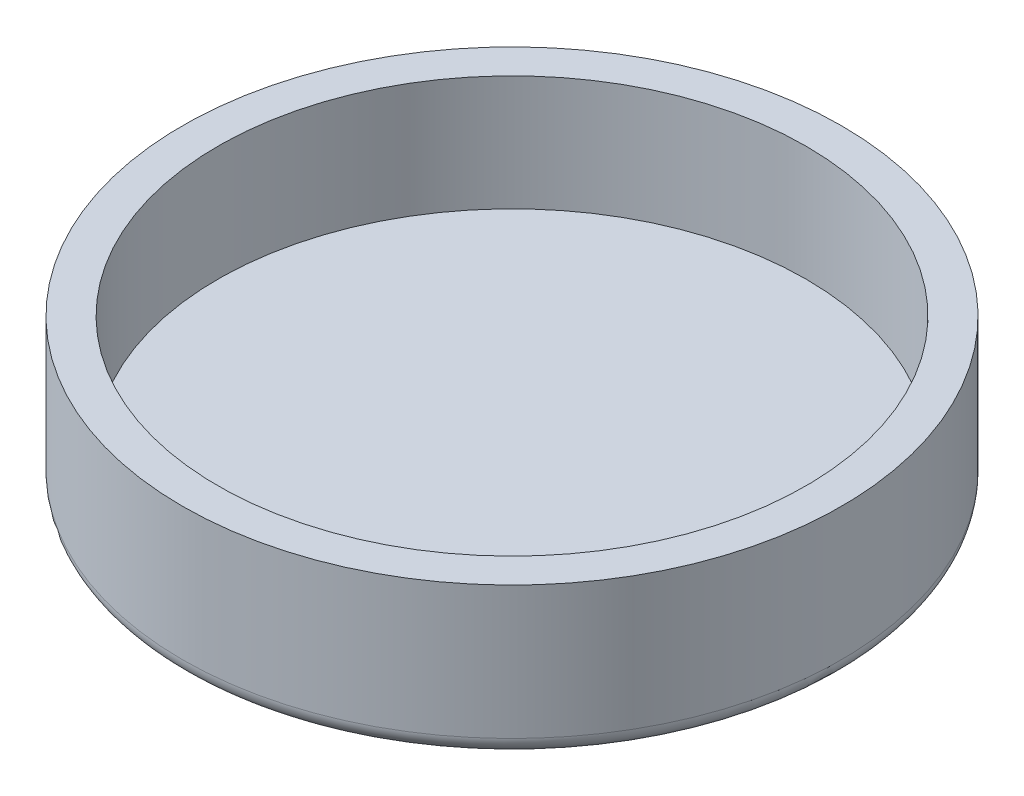
ISO-10303-21;
HEADER;
FILE_DESCRIPTION(('STEP AP214'),'2;1');
FILE_NAME('part.step','',(''),(''),'','','');
FILE_SCHEMA(('AUTOMOTIVE_DESIGN { 1 0 10303 214 1 1 1 1 }'));
ENDSEC;
DATA;
#1=APPLICATION_CONTEXT('core data for automotive mechanical design processes');
#2=APPLICATION_PROTOCOL_DEFINITION('international standard','automotive_design',2000,#1);
#3=PRODUCT_CONTEXT('',#1,'mechanical');
#4=PRODUCT('Part','Part','',(#3));
#5=PRODUCT_RELATED_PRODUCT_CATEGORY('part','',(#4));
#6=PRODUCT_DEFINITION_FORMATION('','',#4);
#7=PRODUCT_DEFINITION_CONTEXT('part definition',#1,'design');
#8=PRODUCT_DEFINITION('design','',#6,#7);
#9=PRODUCT_DEFINITION_SHAPE('','',#8);
#10=(LENGTH_UNIT() NAMED_UNIT(*) SI_UNIT(.MILLI.,.METRE.));
#11=(NAMED_UNIT(*) PLANE_ANGLE_UNIT() SI_UNIT($,.RADIAN.));
#12=(NAMED_UNIT(*) SI_UNIT($,.STERADIAN.) SOLID_ANGLE_UNIT());
#13=UNCERTAINTY_MEASURE_WITH_UNIT(LENGTH_MEASURE(1.E-05),#10,'distance_accuracy_value','');
#14=(GEOMETRIC_REPRESENTATION_CONTEXT(3) GLOBAL_UNCERTAINTY_ASSIGNED_CONTEXT((#13)) GLOBAL_UNIT_ASSIGNED_CONTEXT((#10,
#11,#12)) REPRESENTATION_CONTEXT('',''));
#15=CARTESIAN_POINT('',(0.,0.,0.));
#16=DIRECTION('',(0.,0.,1.));
#17=DIRECTION('',(1.,0.,0.));
#18=AXIS2_PLACEMENT_3D('',#15,#16,#17);
#19=CARTESIAN_POINT('',(0.,0.,0.));
#20=DIRECTION('',(0.,1.,0.));
#21=DIRECTION('',(0.,0.,1.));
#22=AXIS2_PLACEMENT_3D('',#19,#20,#21);
#23=PLANE('',#22);
#24=CARTESIAN_POINT('',(0.,0.,0.));
#25=DIRECTION('',(0.,-1.,0.));
#26=DIRECTION('',(0.,0.,-1.));
#27=AXIS2_PLACEMENT_3D('',#24,#25,#26);
#28=CIRCLE('',#27,8.8);
#29=CARTESIAN_POINT('',(0.,0.,-8.8));
#30=VERTEX_POINT('',#29);
#31=EDGE_CURVE('E10',#30,#30,#28,.T.);
#32=ORIENTED_EDGE('',*,*,#31,.T.);
#33=EDGE_LOOP('',(#32));
#34=FACE_BOUND('',#33,.T.);
#35=ADVANCED_FACE('F39',(#34),#23,.F.);
#36=CARTESIAN_POINT('',(0.,0.499999999999999,0.));
#37=DIRECTION('',(0.,-1.,0.));
#38=DIRECTION('',(0.,0.,-1.));
#39=AXIS2_PLACEMENT_3D('',#36,#37,#38);
#40=TOROIDAL_SURFACE('',#39,8.8,0.5);
#41=ORIENTED_EDGE('',*,*,#31,.F.);
#42=EDGE_LOOP('',(#41));
#43=FACE_BOUND('',#42,.T.);
#44=CARTESIAN_POINT('',(0.,0.499999999999999,0.));
#45=DIRECTION('',(0.,-1.,0.));
#46=DIRECTION('',(0.,0.,-1.));
#47=AXIS2_PLACEMENT_3D('',#44,#45,#46);
#48=CIRCLE('',#47,9.3);
#49=CARTESIAN_POINT('',(0.,0.499999999999999,-9.3));
#50=VERTEX_POINT('',#49);
#51=EDGE_CURVE('E46',#50,#50,#48,.T.);
#52=ORIENTED_EDGE('',*,*,#51,.T.);
#53=EDGE_LOOP('',(#52));
#54=FACE_BOUND('',#53,.T.);
#55=ADVANCED_FACE('F82',(#43,#54),#40,.T.);
#56=CARTESIAN_POINT('',(0.,0.999999999999999,0.));
#57=DIRECTION('',(0.,-1.,0.));
#58=DIRECTION('',(0.,0.,-1.));
#59=AXIS2_PLACEMENT_3D('',#56,#57,#58);
#60=CYLINDRICAL_SURFACE('',#59,9.3);
#61=ORIENTED_EDGE('',*,*,#51,.F.);
#62=EDGE_LOOP('',(#61));
#63=FACE_BOUND('',#62,.T.);
#64=CARTESIAN_POINT('',(0.,4.25,0.));
#65=DIRECTION('',(0.,-1.,0.));
#66=DIRECTION('',(0.,0.,-1.));
#67=AXIS2_PLACEMENT_3D('',#64,#65,#66);
#68=CIRCLE('',#67,9.3);
#69=CARTESIAN_POINT('',(0.,4.25,-9.3));
#70=VERTEX_POINT('',#69);
#71=EDGE_CURVE('E52',#70,#70,#68,.T.);
#72=ORIENTED_EDGE('',*,*,#71,.T.);
#73=EDGE_LOOP('',(#72));
#74=FACE_BOUND('',#73,.T.);
#75=ADVANCED_FACE('F86',(#63,#74),#60,.T.);
#76=CARTESIAN_POINT('',(-9.3,4.25,0.));
#77=DIRECTION('',(0.,-1.,0.));
#78=DIRECTION('',(0.,0.,-1.));
#79=AXIS2_PLACEMENT_3D('',#76,#77,#78);
#80=PLANE('',#79);
#81=ORIENTED_EDGE('',*,*,#71,.F.);
#82=EDGE_LOOP('',(#81));
#83=FACE_BOUND('',#82,.T.);
#84=CARTESIAN_POINT('',(0.,4.25,0.));
#85=DIRECTION('',(0.,-1.,0.));
#86=DIRECTION('',(0.,0.,-1.));
#87=AXIS2_PLACEMENT_3D('',#84,#85,#86);
#88=CIRCLE('',#87,8.3);
#89=CARTESIAN_POINT('',(0.,4.25,-8.3));
#90=VERTEX_POINT('',#89);
#91=EDGE_CURVE('E58',#90,#90,#88,.T.);
#92=ORIENTED_EDGE('',*,*,#91,.T.);
#93=EDGE_LOOP('',(#92));
#94=FACE_BOUND('',#93,.T.);
#95=ADVANCED_FACE('F78',(#83,#94),#80,.F.);
#96=CARTESIAN_POINT('',(0.,0.999999999999999,0.));
#97=DIRECTION('',(0.,-1.,0.));
#98=DIRECTION('',(0.,0.,-1.));
#99=AXIS2_PLACEMENT_3D('',#96,#97,#98);
#100=CYLINDRICAL_SURFACE('',#99,8.3);
#101=ORIENTED_EDGE('',*,*,#91,.F.);
#102=EDGE_LOOP('',(#101));
#103=FACE_BOUND('',#102,.T.);
#104=CARTESIAN_POINT('',(0.,0.999999999999999,0.));
#105=DIRECTION('',(0.,-1.,0.));
#106=DIRECTION('',(0.,0.,-1.));
#107=AXIS2_PLACEMENT_3D('',#104,#105,#106);
#108=CIRCLE('',#107,8.3);
#109=CARTESIAN_POINT('',(0.,0.999999999999999,-8.3));
#110=VERTEX_POINT('',#109);
#111=EDGE_CURVE('E64',#110,#110,#108,.T.);
#112=ORIENTED_EDGE('',*,*,#111,.T.);
#113=EDGE_LOOP('',(#112));
#114=FACE_BOUND('',#113,.T.);
#115=ADVANCED_FACE('F70',(#103,#114),#100,.F.);
#116=CARTESIAN_POINT('',(-1.,0.999999999999999,0.));
#117=DIRECTION('',(0.,-1.,0.));
#118=DIRECTION('',(0.,0.,-1.));
#119=AXIS2_PLACEMENT_3D('',#116,#117,#118);
#120=PLANE('',#119);
#121=ORIENTED_EDGE('',*,*,#111,.F.);
#122=EDGE_LOOP('',(#121));
#123=FACE_BOUND('',#122,.T.);
#124=ADVANCED_FACE('F72',(#123),#120,.F.);
#125=CLOSED_SHELL('',(#35,#55,#75,#95,#115,#124));
#126=MANIFOLD_SOLID_BREP('B2',#125);
#127=ADVANCED_BREP_SHAPE_REPRESENTATION('',(#18,#126),#14);
#128=SHAPE_DEFINITION_REPRESENTATION(#9,#127);
ENDSEC;
END-ISO-10303-21;
